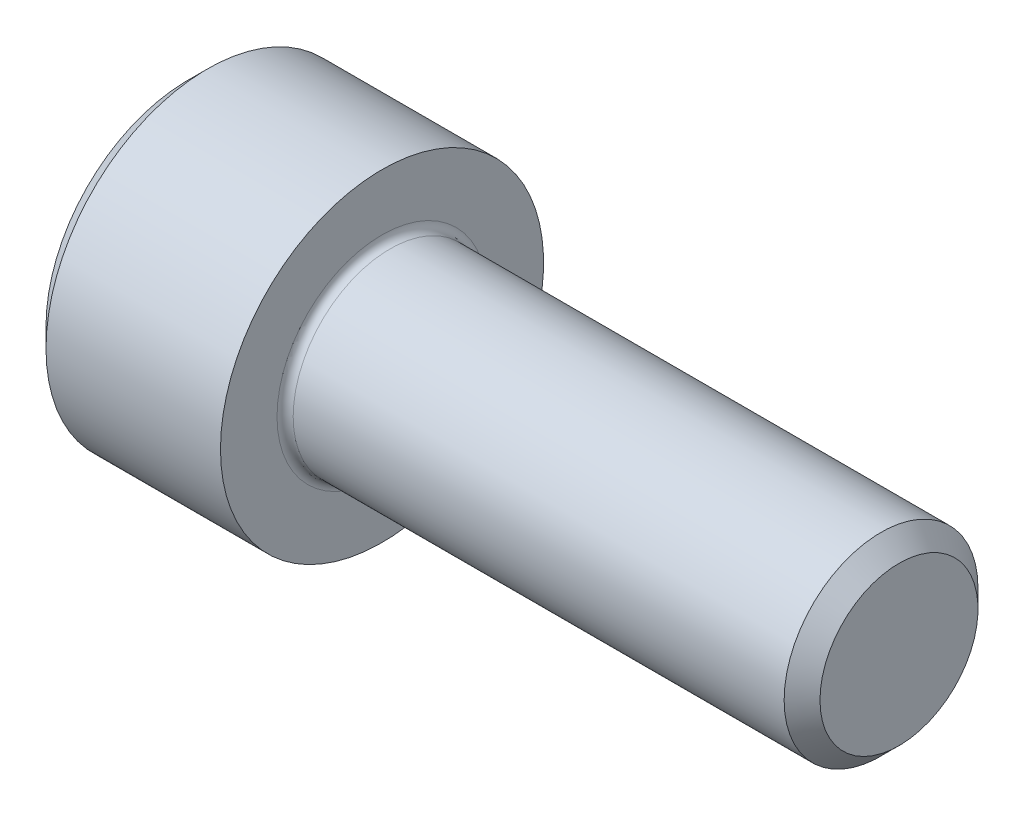
ISO-10303-21;
HEADER;
FILE_DESCRIPTION(('STEP AP214'),'2;1');
FILE_NAME('part.step','',(''),(''),'','','');
FILE_SCHEMA(('AUTOMOTIVE_DESIGN { 1 0 10303 214 1 1 1 1 }'));
ENDSEC;
DATA;
#1=APPLICATION_CONTEXT('core data for automotive mechanical design processes');
#2=APPLICATION_PROTOCOL_DEFINITION('international standard','automotive_design',2000,#1);
#3=PRODUCT_CONTEXT('',#1,'mechanical');
#4=PRODUCT('Part','Part','',(#3));
#5=PRODUCT_RELATED_PRODUCT_CATEGORY('part','',(#4));
#6=PRODUCT_DEFINITION_FORMATION('','',#4);
#7=PRODUCT_DEFINITION_CONTEXT('part definition',#1,'design');
#8=PRODUCT_DEFINITION('design','',#6,#7);
#9=PRODUCT_DEFINITION_SHAPE('','',#8);
#10=(LENGTH_UNIT() NAMED_UNIT(*) SI_UNIT(.MILLI.,.METRE.));
#11=(NAMED_UNIT(*) PLANE_ANGLE_UNIT() SI_UNIT($,.RADIAN.));
#12=(NAMED_UNIT(*) SI_UNIT($,.STERADIAN.) SOLID_ANGLE_UNIT());
#13=UNCERTAINTY_MEASURE_WITH_UNIT(LENGTH_MEASURE(1.E-05),#10,'distance_accuracy_value','');
#14=(GEOMETRIC_REPRESENTATION_CONTEXT(3) GLOBAL_UNCERTAINTY_ASSIGNED_CONTEXT((#13)) GLOBAL_UNIT_ASSIGNED_CONTEXT((#10,
#11,#12)) REPRESENTATION_CONTEXT('',''));
#15=CARTESIAN_POINT('',(0.,0.,0.));
#16=DIRECTION('',(0.,0.,1.));
#17=DIRECTION('',(1.,0.,0.));
#18=AXIS2_PLACEMENT_3D('',#15,#16,#17);
#19=CARTESIAN_POINT('',(0.,0.,0.));
#20=DIRECTION('',(-1.,0.,0.));
#21=DIRECTION('',(0.,0.,1.));
#22=AXIS2_PLACEMENT_3D('',#19,#20,#21);
#23=PLANE('',#22);
#24=DIRECTION('',(0.,-0.5,0.866025403784438));
#25=VECTOR('',#24,1.);
#26=CARTESIAN_POINT('',(0.,2.93524876856006,0.));
#27=LINE('',#26,#25);
#28=CARTESIAN_POINT('',(0.,2.93524876856006,0.));
#29=VERTEX_POINT('',#28);
#30=CARTESIAN_POINT('',(0.,1.46762438428003,2.542));
#31=VERTEX_POINT('',#30);
#32=EDGE_CURVE('E387',#29,#31,#27,.T.);
#33=ORIENTED_EDGE('',*,*,#32,.T.);
#34=DIRECTION('',(0.,1.,0.));
#35=VECTOR('',#34,1.);
#36=CARTESIAN_POINT('',(0.,-1.46762438428003,2.542));
#37=LINE('',#36,#35);
#38=CARTESIAN_POINT('',(0.,-1.46762438428003,2.542));
#39=VERTEX_POINT('',#38);
#40=EDGE_CURVE('E131',#39,#31,#37,.T.);
#41=ORIENTED_EDGE('',*,*,#40,.F.);
#42=DIRECTION('',(0.,-0.500000000000001,-0.866025403784438));
#43=VECTOR('',#42,1.);
#44=CARTESIAN_POINT('',(0.,-1.46762438428003,2.542));
#45=LINE('',#44,#43);
#46=CARTESIAN_POINT('',(0.,-2.93524876856006,0.));
#47=VERTEX_POINT('',#46);
#48=EDGE_CURVE('E390',#39,#47,#45,.T.);
#49=ORIENTED_EDGE('',*,*,#48,.T.);
#50=DIRECTION('',(0.,0.5,-0.866025403784439));
#51=VECTOR('',#50,1.);
#52=CARTESIAN_POINT('',(0.,-2.93524876856006,0.));
#53=LINE('',#52,#51);
#54=CARTESIAN_POINT('',(0.,-1.46762438428003,-2.542));
#55=VERTEX_POINT('',#54);
#56=EDGE_CURVE('E393',#47,#55,#53,.T.);
#57=ORIENTED_EDGE('',*,*,#56,.T.);
#58=DIRECTION('',(0.,-1.,0.));
#59=VECTOR('',#58,1.);
#60=CARTESIAN_POINT('',(0.,1.46762438428002,-2.542));
#61=LINE('',#60,#59);
#62=CARTESIAN_POINT('',(0.,1.46762438428002,-2.542));
#63=VERTEX_POINT('',#62);
#64=EDGE_CURVE('E396',#63,#55,#61,.T.);
#65=ORIENTED_EDGE('',*,*,#64,.F.);
#66=DIRECTION('',(0.,-0.500000000000001,-0.866025403784438));
#67=VECTOR('',#66,1.);
#68=CARTESIAN_POINT('',(0.,2.93524876856006,0.));
#69=LINE('',#68,#67);
#70=EDGE_CURVE('E126',#29,#63,#69,.T.);
#71=ORIENTED_EDGE('',*,*,#70,.F.);
#72=EDGE_LOOP('',(#33,#41,#49,#57,#65,#71));
#73=FACE_BOUND('',#72,.T.);
#74=CARTESIAN_POINT('',(0.,0.,0.));
#75=DIRECTION('',(-1.,0.,0.));
#76=DIRECTION('',(0.,0.,1.));
#77=AXIS2_PLACEMENT_3D('',#74,#75,#76);
#78=CIRCLE('',#77,4.4);
#79=CARTESIAN_POINT('',(0.,0.,4.4));
#80=VERTEX_POINT('',#79);
#81=EDGE_CURVE('E142',#80,#80,#78,.T.);
#82=ORIENTED_EDGE('',*,*,#81,.T.);
#83=EDGE_LOOP('',(#82));
#84=FACE_BOUND('',#83,.T.);
#85=ADVANCED_FACE('F35',(#73,#84),#23,.T.);
#86=CARTESIAN_POINT('',(22.,2.4455,0.));
#87=DIRECTION('',(1.,0.,0.));
#88=DIRECTION('',(0.,0.,-1.));
#89=AXIS2_PLACEMENT_3D('',#86,#87,#88);
#90=PLANE('',#89);
#91=CARTESIAN_POINT('',(22.,0.,0.));
#92=DIRECTION('',(-1.,0.,0.));
#93=DIRECTION('',(0.,0.,1.));
#94=AXIS2_PLACEMENT_3D('',#91,#92,#93);
#95=CIRCLE('',#94,2.4455);
#96=CARTESIAN_POINT('',(22.,0.,2.4455));
#97=VERTEX_POINT('',#96);
#98=EDGE_CURVE('E155',#97,#97,#95,.T.);
#99=ORIENTED_EDGE('',*,*,#98,.F.);
#100=EDGE_LOOP('',(#99));
#101=FACE_BOUND('',#100,.T.);
#102=ADVANCED_FACE('F176',(#101),#90,.T.);
#103=CARTESIAN_POINT('',(22.,0.,0.));
#104=DIRECTION('',(-1.,0.,0.));
#105=DIRECTION('',(0.,0.,1.));
#106=AXIS2_PLACEMENT_3D('',#103,#104,#105);
#107=CONICAL_SURFACE('',#106,2.4455,0.78539816339739);
#108=CARTESIAN_POINT('',(21.4455,0.,0.));
#109=DIRECTION('',(-1.,0.,0.));
#110=DIRECTION('',(0.,0.,1.));
#111=AXIS2_PLACEMENT_3D('',#108,#109,#110);
#112=CIRCLE('',#111,2.99999999999996);
#113=CARTESIAN_POINT('',(21.4455,0.,2.99999999999996));
#114=VERTEX_POINT('',#113);
#115=EDGE_CURVE('E152',#114,#114,#112,.T.);
#116=ORIENTED_EDGE('',*,*,#115,.F.);
#117=EDGE_LOOP('',(#116));
#118=FACE_BOUND('',#117,.T.);
#119=ORIENTED_EDGE('',*,*,#98,.T.);
#120=EDGE_LOOP('',(#119));
#121=FACE_BOUND('',#120,.T.);
#122=ADVANCED_FACE('F182',(#118,#121),#107,.T.);
#123=CARTESIAN_POINT('',(-31.75,0.,0.));
#124=DIRECTION('',(-1.,0.,0.));
#125=DIRECTION('',(0.,0.,1.));
#126=AXIS2_PLACEMENT_3D('',#123,#124,#125);
#127=CYLINDRICAL_SURFACE('',#126,2.99999999999998);
#128=CARTESIAN_POINT('',(6.25,0.,0.));
#129=DIRECTION('',(1.,0.,0.));
#130=DIRECTION('',(0.,0.,-1.));
#131=AXIS2_PLACEMENT_3D('',#128,#129,#130);
#132=CIRCLE('',#131,2.99999999999998);
#133=CARTESIAN_POINT('',(6.25,0.,-2.99999999999998));
#134=VERTEX_POINT('',#133);
#135=EDGE_CURVE('E11',#134,#134,#132,.T.);
#136=ORIENTED_EDGE('',*,*,#135,.T.);
#137=EDGE_LOOP('',(#136));
#138=FACE_BOUND('',#137,.T.);
#139=ORIENTED_EDGE('',*,*,#115,.T.);
#140=EDGE_LOOP('',(#139));
#141=FACE_BOUND('',#140,.T.);
#142=ADVANCED_FACE('F193',(#138,#141),#127,.T.);
#143=CARTESIAN_POINT('',(6.,5.,0.));
#144=DIRECTION('',(1.,0.,0.));
#145=DIRECTION('',(0.,0.,-1.));
#146=AXIS2_PLACEMENT_3D('',#143,#144,#145);
#147=PLANE('',#146);
#148=CARTESIAN_POINT('',(6.,0.,0.));
#149=DIRECTION('',(1.,0.,0.));
#150=DIRECTION('',(0.,0.,-1.));
#151=AXIS2_PLACEMENT_3D('',#148,#149,#150);
#152=CIRCLE('',#151,3.24999999999998);
#153=CARTESIAN_POINT('',(6.,0.,-3.24999999999998));
#154=VERTEX_POINT('',#153);
#155=EDGE_CURVE('E43',#154,#154,#152,.F.);
#156=ORIENTED_EDGE('',*,*,#155,.T.);
#157=EDGE_LOOP('',(#156));
#158=FACE_BOUND('',#157,.T.);
#159=CARTESIAN_POINT('',(6.,0.,0.));
#160=DIRECTION('',(-1.,0.,0.));
#161=DIRECTION('',(0.,0.,1.));
#162=AXIS2_PLACEMENT_3D('',#159,#160,#161);
#163=CIRCLE('',#162,5.);
#164=CARTESIAN_POINT('',(6.,0.,5.));
#165=VERTEX_POINT('',#164);
#166=EDGE_CURVE('E149',#165,#165,#163,.T.);
#167=ORIENTED_EDGE('',*,*,#166,.F.);
#168=EDGE_LOOP('',(#167));
#169=FACE_BOUND('',#168,.T.);
#170=ADVANCED_FACE('F160',(#158,#169),#147,.T.);
#171=CARTESIAN_POINT('',(-31.75,0.,0.));
#172=DIRECTION('',(-1.,0.,0.));
#173=DIRECTION('',(0.,0.,1.));
#174=AXIS2_PLACEMENT_3D('',#171,#172,#173);
#175=CYLINDRICAL_SURFACE('',#174,5.);
#176=ORIENTED_EDGE('',*,*,#166,.T.);
#177=EDGE_LOOP('',(#176));
#178=FACE_BOUND('',#177,.T.);
#179=CARTESIAN_POINT('',(0.600000000000003,0.,0.));
#180=DIRECTION('',(-1.,0.,0.));
#181=DIRECTION('',(0.,0.,1.));
#182=AXIS2_PLACEMENT_3D('',#179,#180,#181);
#183=CIRCLE('',#182,5.);
#184=CARTESIAN_POINT('',(0.600000000000003,0.,5.));
#185=VERTEX_POINT('',#184);
#186=EDGE_CURVE('E146',#185,#185,#183,.T.);
#187=ORIENTED_EDGE('',*,*,#186,.F.);
#188=EDGE_LOOP('',(#187));
#189=FACE_BOUND('',#188,.T.);
#190=ADVANCED_FACE('F171',(#178,#189),#175,.T.);
#191=CARTESIAN_POINT('',(0.,0.,0.));
#192=DIRECTION('',(1.,0.,0.));
#193=DIRECTION('',(0.,0.,-1.));
#194=AXIS2_PLACEMENT_3D('',#191,#192,#193);
#195=CONICAL_SURFACE('',#194,4.4,0.785398163397445);
#196=ORIENTED_EDGE('',*,*,#186,.T.);
#197=EDGE_LOOP('',(#196));
#198=FACE_BOUND('',#197,.T.);
#199=ORIENTED_EDGE('',*,*,#81,.F.);
#200=EDGE_LOOP('',(#199));
#201=FACE_BOUND('',#200,.T.);
#202=ADVANCED_FACE('F164',(#198,#201),#195,.T.);
#203=CARTESIAN_POINT('',(6.25,0.,0.));
#204=DIRECTION('',(1.,0.,0.));
#205=DIRECTION('',(0.,0.,-1.));
#206=AXIS2_PLACEMENT_3D('',#203,#204,#205);
#207=TOROIDAL_SURFACE('',#206,3.24999999999998,0.25);
#208=ORIENTED_EDGE('',*,*,#135,.F.);
#209=EDGE_LOOP('',(#208));
#210=FACE_BOUND('',#209,.T.);
#211=ORIENTED_EDGE('',*,*,#155,.F.);
#212=EDGE_LOOP('',(#211));
#213=FACE_BOUND('',#212,.T.);
#214=ADVANCED_FACE('F37',(#210,#213),#207,.F.);
#215=CARTESIAN_POINT('',(3.,2.93524876856006,0.));
#216=DIRECTION('',(0.,-0.866025403784439,-0.5));
#217=DIRECTION('',(0.,0.5,-0.866025403784439));
#218=AXIS2_PLACEMENT_3D('',#215,#216,#217);
#219=PLANE('',#218);
#220=ORIENTED_EDGE('',*,*,#32,.F.);
#221=DIRECTION('',(-1.,0.,0.));
#222=VECTOR('',#221,1.);
#223=CARTESIAN_POINT('',(3.,2.93524876856006,0.));
#224=LINE('',#223,#222);
#225=CARTESIAN_POINT('',(3.,2.93524876856006,0.));
#226=VERTEX_POINT('',#225);
#227=EDGE_CURVE('E377',#226,#29,#224,.T.);
#228=ORIENTED_EDGE('',*,*,#227,.F.);
#229=DIRECTION('',(0.,-0.5,0.866025403784438));
#230=VECTOR('',#229,1.);
#231=CARTESIAN_POINT('',(3.,2.93524876856006,0.));
#232=LINE('',#231,#230);
#233=CARTESIAN_POINT('',(3.,2.20143657642004,1.271));
#234=VERTEX_POINT('',#233);
#235=EDGE_CURVE('E118',#226,#234,#232,.T.);
#236=ORIENTED_EDGE('',*,*,#235,.T.);
#237=CARTESIAN_POINT('',(3.,1.46762438428003,2.542));
#238=VERTEX_POINT('',#237);
#239=EDGE_CURVE('E109',#234,#238,#232,.T.);
#240=ORIENTED_EDGE('',*,*,#239,.T.);
#241=DIRECTION('',(-1.,0.,0.));
#242=VECTOR('',#241,1.);
#243=CARTESIAN_POINT('',(3.,1.46762438428003,2.542));
#244=LINE('',#243,#242);
#245=EDGE_CURVE('E123',#238,#31,#244,.T.);
#246=ORIENTED_EDGE('',*,*,#245,.T.);
#247=EDGE_LOOP('',(#220,#228,#236,#240,#246));
#248=FACE_BOUND('',#247,.T.);
#249=ADVANCED_FACE('F122',(#248),#219,.T.);
#250=CARTESIAN_POINT('',(3.,-1.46762438428003,2.542));
#251=DIRECTION('',(0.,0.,1.));
#252=DIRECTION('',(0.,-1.,0.));
#253=AXIS2_PLACEMENT_3D('',#250,#251,#252);
#254=PLANE('',#253);
#255=ORIENTED_EDGE('',*,*,#40,.T.);
#256=ORIENTED_EDGE('',*,*,#245,.F.);
#257=DIRECTION('',(0.,1.,0.));
#258=VECTOR('',#257,1.);
#259=CARTESIAN_POINT('',(3.,-1.46762438428003,2.542));
#260=LINE('',#259,#258);
#261=CARTESIAN_POINT('',(3.,0.,2.542));
#262=VERTEX_POINT('',#261);
#263=EDGE_CURVE('E106',#262,#238,#260,.T.);
#264=ORIENTED_EDGE('',*,*,#263,.F.);
#265=CARTESIAN_POINT('',(3.,-1.46762438428003,2.542));
#266=VERTEX_POINT('',#265);
#267=EDGE_CURVE('E117',#266,#262,#260,.T.);
#268=ORIENTED_EDGE('',*,*,#267,.F.);
#269=DIRECTION('',(-1.,0.,0.));
#270=VECTOR('',#269,1.);
#271=CARTESIAN_POINT('',(3.,-1.46762438428003,2.542));
#272=LINE('',#271,#270);
#273=EDGE_CURVE('E133',#266,#39,#272,.T.);
#274=ORIENTED_EDGE('',*,*,#273,.T.);
#275=EDGE_LOOP('',(#255,#256,#264,#268,#274));
#276=FACE_BOUND('',#275,.T.);
#277=ADVANCED_FACE('F128',(#276),#254,.F.);
#278=CARTESIAN_POINT('',(3.,-1.46762438428003,2.542));
#279=DIRECTION('',(0.,0.866025403784438,-0.500000000000001));
#280=DIRECTION('',(0.,0.500000000000001,0.866025403784438));
#281=AXIS2_PLACEMENT_3D('',#278,#279,#280);
#282=PLANE('',#281);
#283=ORIENTED_EDGE('',*,*,#48,.F.);
#284=ORIENTED_EDGE('',*,*,#273,.F.);
#285=DIRECTION('',(0.,-0.500000000000001,-0.866025403784438));
#286=VECTOR('',#285,1.);
#287=CARTESIAN_POINT('',(3.,-1.46762438428003,2.542));
#288=LINE('',#287,#286);
#289=CARTESIAN_POINT('',(3.,-2.20143657642004,1.271));
#290=VERTEX_POINT('',#289);
#291=EDGE_CURVE('E416',#266,#290,#288,.T.);
#292=ORIENTED_EDGE('',*,*,#291,.T.);
#293=CARTESIAN_POINT('',(3.,-2.93524876856006,0.));
#294=VERTEX_POINT('',#293);
#295=EDGE_CURVE('E405',#290,#294,#288,.T.);
#296=ORIENTED_EDGE('',*,*,#295,.T.);
#297=DIRECTION('',(-1.,0.,0.));
#298=VECTOR('',#297,1.);
#299=CARTESIAN_POINT('',(3.,-2.93524876856006,0.));
#300=LINE('',#299,#298);
#301=EDGE_CURVE('E138',#294,#47,#300,.T.);
#302=ORIENTED_EDGE('',*,*,#301,.T.);
#303=EDGE_LOOP('',(#283,#284,#292,#296,#302));
#304=FACE_BOUND('',#303,.T.);
#305=ADVANCED_FACE('F268',(#304),#282,.T.);
#306=CARTESIAN_POINT('',(3.,-2.93524876856006,0.));
#307=DIRECTION('',(0.,0.866025403784439,0.5));
#308=DIRECTION('',(0.,-0.5,0.866025403784439));
#309=AXIS2_PLACEMENT_3D('',#306,#307,#308);
#310=PLANE('',#309);
#311=ORIENTED_EDGE('',*,*,#56,.F.);
#312=ORIENTED_EDGE('',*,*,#301,.F.);
#313=DIRECTION('',(0.,0.5,-0.866025403784439));
#314=VECTOR('',#313,1.);
#315=CARTESIAN_POINT('',(3.,-2.93524876856006,0.));
#316=LINE('',#315,#314);
#317=CARTESIAN_POINT('',(3.,-2.20143657642005,-1.271));
#318=VERTEX_POINT('',#317);
#319=EDGE_CURVE('E383',#294,#318,#316,.T.);
#320=ORIENTED_EDGE('',*,*,#319,.T.);
#321=CARTESIAN_POINT('',(3.,-1.46762438428003,-2.542));
#322=VERTEX_POINT('',#321);
#323=EDGE_CURVE('E415',#318,#322,#316,.T.);
#324=ORIENTED_EDGE('',*,*,#323,.T.);
#325=DIRECTION('',(-1.,0.,0.));
#326=VECTOR('',#325,1.);
#327=CARTESIAN_POINT('',(3.,-1.46762438428003,-2.542));
#328=LINE('',#327,#326);
#329=EDGE_CURVE('E376',#322,#55,#328,.T.);
#330=ORIENTED_EDGE('',*,*,#329,.T.);
#331=EDGE_LOOP('',(#311,#312,#320,#324,#330));
#332=FACE_BOUND('',#331,.T.);
#333=ADVANCED_FACE('F276',(#332),#310,.T.);
#334=CARTESIAN_POINT('',(3.,1.46762438428002,-2.542));
#335=DIRECTION('',(0.,0.,-1.));
#336=DIRECTION('',(0.,1.,0.));
#337=AXIS2_PLACEMENT_3D('',#334,#335,#336);
#338=PLANE('',#337);
#339=ORIENTED_EDGE('',*,*,#64,.T.);
#340=ORIENTED_EDGE('',*,*,#329,.F.);
#341=DIRECTION('',(0.,-1.,0.));
#342=VECTOR('',#341,1.);
#343=CARTESIAN_POINT('',(3.,1.46762438428002,-2.542));
#344=LINE('',#343,#342);
#345=CARTESIAN_POINT('',(3.,0.,-2.542));
#346=VERTEX_POINT('',#345);
#347=EDGE_CURVE('E380',#346,#322,#344,.T.);
#348=ORIENTED_EDGE('',*,*,#347,.F.);
#349=CARTESIAN_POINT('',(3.,1.46762438428002,-2.542));
#350=VERTEX_POINT('',#349);
#351=EDGE_CURVE('E50',#350,#346,#344,.T.);
#352=ORIENTED_EDGE('',*,*,#351,.F.);
#353=DIRECTION('',(-1.,0.,0.));
#354=VECTOR('',#353,1.);
#355=CARTESIAN_POINT('',(3.,1.46762438428002,-2.542));
#356=LINE('',#355,#354);
#357=EDGE_CURVE('E373',#350,#63,#356,.T.);
#358=ORIENTED_EDGE('',*,*,#357,.T.);
#359=EDGE_LOOP('',(#339,#340,#348,#352,#358));
#360=FACE_BOUND('',#359,.T.);
#361=ADVANCED_FACE('F285',(#360),#338,.F.);
#362=CARTESIAN_POINT('',(3.,2.93524876856006,0.));
#363=DIRECTION('',(0.,0.866025403784438,-0.500000000000001));
#364=DIRECTION('',(0.,0.500000000000001,0.866025403784438));
#365=AXIS2_PLACEMENT_3D('',#362,#363,#364);
#366=PLANE('',#365);
#367=ORIENTED_EDGE('',*,*,#70,.T.);
#368=ORIENTED_EDGE('',*,*,#357,.F.);
#369=DIRECTION('',(0.,-0.500000000000001,-0.866025403784438));
#370=VECTOR('',#369,1.);
#371=CARTESIAN_POINT('',(3.,2.93524876856006,0.));
#372=LINE('',#371,#370);
#373=CARTESIAN_POINT('',(3.,2.20143657642004,-1.271));
#374=VERTEX_POINT('',#373);
#375=EDGE_CURVE('E363',#374,#350,#372,.T.);
#376=ORIENTED_EDGE('',*,*,#375,.F.);
#377=EDGE_CURVE('E369',#226,#374,#372,.T.);
#378=ORIENTED_EDGE('',*,*,#377,.F.);
#379=ORIENTED_EDGE('',*,*,#227,.T.);
#380=EDGE_LOOP('',(#367,#368,#376,#378,#379));
#381=FACE_BOUND('',#380,.T.);
#382=ADVANCED_FACE('F294',(#381),#366,.F.);
#383=CARTESIAN_POINT('',(3.,2.93524876856006,0.));
#384=DIRECTION('',(1.,0.,0.));
#385=DIRECTION('',(0.,0.,-1.));
#386=AXIS2_PLACEMENT_3D('',#383,#384,#385);
#387=PLANE('',#386);
#388=ORIENTED_EDGE('',*,*,#347,.T.);
#389=ORIENTED_EDGE('',*,*,#323,.F.);
#390=CARTESIAN_POINT('',(3.,0.,0.));
#391=DIRECTION('',(-1.,0.,0.));
#392=DIRECTION('',(0.,0.,1.));
#393=AXIS2_PLACEMENT_3D('',#390,#391,#392);
#394=CIRCLE('',#393,2.542);
#395=EDGE_CURVE('E411',#346,#318,#394,.T.);
#396=ORIENTED_EDGE('',*,*,#395,.F.);
#397=EDGE_LOOP('',(#388,#389,#396));
#398=FACE_BOUND('',#397,.T.);
#399=ADVANCED_FACE('F303',(#398),#387,.F.);
#400=ORIENTED_EDGE('',*,*,#319,.F.);
#401=ORIENTED_EDGE('',*,*,#295,.F.);
#402=EDGE_CURVE('E136',#318,#290,#394,.T.);
#403=ORIENTED_EDGE('',*,*,#402,.F.);
#404=EDGE_LOOP('',(#400,#401,#403));
#405=FACE_BOUND('',#404,.T.);
#406=ADVANCED_FACE('F312',(#405),#387,.F.);
#407=ORIENTED_EDGE('',*,*,#291,.F.);
#408=ORIENTED_EDGE('',*,*,#267,.T.);
#409=EDGE_CURVE('E132',#290,#262,#394,.T.);
#410=ORIENTED_EDGE('',*,*,#409,.F.);
#411=EDGE_LOOP('',(#407,#408,#410));
#412=FACE_BOUND('',#411,.T.);
#413=ADVANCED_FACE('F321',(#412),#387,.F.);
#414=ORIENTED_EDGE('',*,*,#263,.T.);
#415=ORIENTED_EDGE('',*,*,#239,.F.);
#416=EDGE_CURVE('E112',#262,#234,#394,.T.);
#417=ORIENTED_EDGE('',*,*,#416,.F.);
#418=EDGE_LOOP('',(#414,#415,#417));
#419=FACE_BOUND('',#418,.T.);
#420=ADVANCED_FACE('F108',(#419),#387,.F.);
#421=ORIENTED_EDGE('',*,*,#235,.F.);
#422=ORIENTED_EDGE('',*,*,#377,.T.);
#423=EDGE_CURVE('E143',#234,#374,#394,.T.);
#424=ORIENTED_EDGE('',*,*,#423,.F.);
#425=EDGE_LOOP('',(#421,#422,#424));
#426=FACE_BOUND('',#425,.T.);
#427=ADVANCED_FACE('F336',(#426),#387,.F.);
#428=ORIENTED_EDGE('',*,*,#375,.T.);
#429=ORIENTED_EDGE('',*,*,#351,.T.);
#430=EDGE_CURVE('E366',#374,#346,#394,.T.);
#431=ORIENTED_EDGE('',*,*,#430,.F.);
#432=EDGE_LOOP('',(#428,#429,#431));
#433=FACE_BOUND('',#432,.T.);
#434=ADVANCED_FACE('F251',(#433),#387,.F.);
#435=CARTESIAN_POINT('',(3.,0.,0.));
#436=DIRECTION('',(-1.,0.,0.));
#437=DIRECTION('',(0.,0.,1.));
#438=AXIS2_PLACEMENT_3D('',#435,#436,#437);
#439=CONICAL_SURFACE('',#438,2.542,1.04719755119659);
#440=CARTESIAN_POINT('',(4.46762438428004,0.,0.));
#441=VERTEX_POINT('',#440);
#442=VERTEX_LOOP('',#441);
#443=FACE_BOUND('',#442,.T.);
#444=ORIENTED_EDGE('',*,*,#416,.T.);
#445=ORIENTED_EDGE('',*,*,#423,.T.);
#446=ORIENTED_EDGE('',*,*,#430,.T.);
#447=ORIENTED_EDGE('',*,*,#395,.T.);
#448=ORIENTED_EDGE('',*,*,#402,.T.);
#449=ORIENTED_EDGE('',*,*,#409,.T.);
#450=EDGE_LOOP('',(#444,#445,#446,#447,#448,#449));
#451=FACE_BOUND('',#450,.T.);
#452=ADVANCED_FACE('F186',(#443,#451),#439,.F.);
#453=CLOSED_SHELL('',(#85,#102,#122,#142,#170,#190,#202,#214,#249,#277,#305,#333,#361,#382,#399,
#406,#413,#420,#427,#434,#452));
#454=MANIFOLD_SOLID_BREP('B2',#453);
#455=ADVANCED_BREP_SHAPE_REPRESENTATION('',(#18,#454),#14);
#456=SHAPE_DEFINITION_REPRESENTATION(#9,#455);
ENDSEC;
END-ISO-10303-21;
